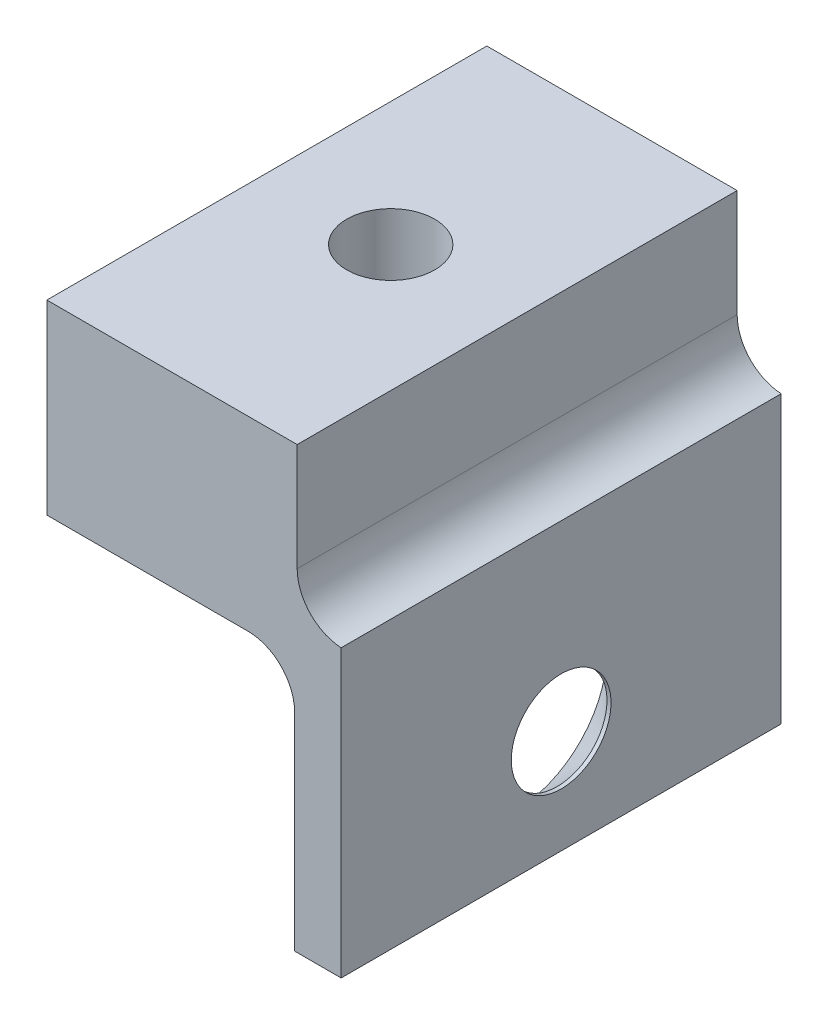
ISO-10303-21;
HEADER;
FILE_DESCRIPTION(('STEP AP214'),'2;1');
FILE_NAME('part.step','',(''),(''),'','','');
FILE_SCHEMA(('AUTOMOTIVE_DESIGN { 1 0 10303 214 1 1 1 1 }'));
ENDSEC;
DATA;
#1=APPLICATION_CONTEXT('core data for automotive mechanical design processes');
#2=APPLICATION_PROTOCOL_DEFINITION('international standard','automotive_design',2000,#1);
#3=PRODUCT_CONTEXT('',#1,'mechanical');
#4=PRODUCT('Part','Part','',(#3));
#5=PRODUCT_RELATED_PRODUCT_CATEGORY('part','',(#4));
#6=PRODUCT_DEFINITION_FORMATION('','',#4);
#7=PRODUCT_DEFINITION_CONTEXT('part definition',#1,'design');
#8=PRODUCT_DEFINITION('design','',#6,#7);
#9=PRODUCT_DEFINITION_SHAPE('','',#8);
#10=(LENGTH_UNIT() NAMED_UNIT(*) SI_UNIT(.MILLI.,.METRE.));
#11=(NAMED_UNIT(*) PLANE_ANGLE_UNIT() SI_UNIT($,.RADIAN.));
#12=(NAMED_UNIT(*) SI_UNIT($,.STERADIAN.) SOLID_ANGLE_UNIT());
#13=UNCERTAINTY_MEASURE_WITH_UNIT(LENGTH_MEASURE(1.E-05),#10,'distance_accuracy_value','');
#14=(GEOMETRIC_REPRESENTATION_CONTEXT(3) GLOBAL_UNCERTAINTY_ASSIGNED_CONTEXT((#13)) GLOBAL_UNIT_ASSIGNED_CONTEXT((#10,
#11,#12)) REPRESENTATION_CONTEXT('',''));
#15=CARTESIAN_POINT('',(0.,0.,0.));
#16=DIRECTION('',(0.,0.,1.));
#17=DIRECTION('',(1.,0.,0.));
#18=AXIS2_PLACEMENT_3D('',#15,#16,#17);
#19=CARTESIAN_POINT('',(0.,-15.0000000000001,7.5));
#20=DIRECTION('',(-1.,0.,0.));
#21=DIRECTION('',(0.,0.,1.));
#22=AXIS2_PLACEMENT_3D('',#19,#20,#21);
#23=PLANE('',#22);
#24=CARTESIAN_POINT('',(0.,-11.4687500000001,0.));
#25=DIRECTION('',(-1.,0.,0.));
#26=DIRECTION('',(0.,0.,1.));
#27=AXIS2_PLACEMENT_3D('',#24,#25,#26);
#28=CIRCLE('',#27,1.7);
#29=CARTESIAN_POINT('',(0.,-11.4687500000001,1.7));
#30=VERTEX_POINT('',#29);
#31=EDGE_CURVE('E240',#30,#30,#28,.T.);
#32=ORIENTED_EDGE('',*,*,#31,.T.);
#33=EDGE_LOOP('',(#32));
#34=FACE_BOUND('',#33,.T.);
#35=DIRECTION('',(0.,1.,0.));
#36=VECTOR('',#35,1.);
#37=CARTESIAN_POINT('',(0.,-15.0000000000001,-7.5));
#38=LINE('',#37,#36);
#39=CARTESIAN_POINT('',(0.,-15.0000000000001,-7.5));
#40=VERTEX_POINT('',#39);
#41=CARTESIAN_POINT('',(0.,-5.25,-7.5));
#42=VERTEX_POINT('',#41);
#43=EDGE_CURVE('E106',#40,#42,#38,.T.);
#44=ORIENTED_EDGE('',*,*,#43,.T.);
#45=DIRECTION('',(0.,0.,1.));
#46=VECTOR('',#45,1.);
#47=CARTESIAN_POINT('',(0.,-5.25,-7.5));
#48=LINE('',#47,#46);
#49=CARTESIAN_POINT('',(0.,-5.25,7.5));
#50=VERTEX_POINT('',#49);
#51=EDGE_CURVE('E115',#42,#50,#48,.T.);
#52=ORIENTED_EDGE('',*,*,#51,.T.);
#53=DIRECTION('',(0.,1.,0.));
#54=VECTOR('',#53,1.);
#55=CARTESIAN_POINT('',(0.,-15.0000000000001,7.5));
#56=LINE('',#55,#54);
#57=CARTESIAN_POINT('',(0.,-15.0000000000001,7.5));
#58=VERTEX_POINT('',#57);
#59=EDGE_CURVE('E131',#58,#50,#56,.T.);
#60=ORIENTED_EDGE('',*,*,#59,.F.);
#61=DIRECTION('',(0.,0.,-1.));
#62=VECTOR('',#61,1.);
#63=CARTESIAN_POINT('',(0.,-15.0000000000001,7.5));
#64=LINE('',#63,#62);
#65=EDGE_CURVE('E117',#58,#40,#64,.T.);
#66=ORIENTED_EDGE('',*,*,#65,.T.);
#67=EDGE_LOOP('',(#44,#52,#60,#66));
#68=FACE_BOUND('',#67,.T.);
#69=ADVANCED_FACE('F33',(#34,#68),#23,.F.);
#70=CARTESIAN_POINT('',(0.,0.,7.5));
#71=DIRECTION('',(0.,-1.,0.));
#72=DIRECTION('',(1.,0.,0.));
#73=AXIS2_PLACEMENT_3D('',#70,#71,#72);
#74=PLANE('',#73);
#75=CARTESIAN_POINT('',(-5.81047243999994,0.,0.));
#76=DIRECTION('',(0.,1.,0.));
#77=DIRECTION('',(0.,0.,1.));
#78=AXIS2_PLACEMENT_3D('',#75,#76,#77);
#79=CIRCLE('',#78,1.5);
#80=CARTESIAN_POINT('',(-5.81047243999994,0.,1.5));
#81=VERTEX_POINT('',#80);
#82=EDGE_CURVE('E123',#81,#81,#79,.T.);
#83=ORIENTED_EDGE('',*,*,#82,.F.);
#84=EDGE_LOOP('',(#83));
#85=FACE_BOUND('',#84,.T.);
#86=DIRECTION('',(-1.,0.,0.));
#87=VECTOR('',#86,1.);
#88=CARTESIAN_POINT('',(0.,0.,7.5));
#89=LINE('',#88,#87);
#90=CARTESIAN_POINT('',(-1.5,0.,7.5));
#91=VERTEX_POINT('',#90);
#92=CARTESIAN_POINT('',(-10.03344488,0.,7.5));
#93=VERTEX_POINT('',#92);
#94=EDGE_CURVE('E133',#91,#93,#89,.T.);
#95=ORIENTED_EDGE('',*,*,#94,.F.);
#96=DIRECTION('',(0.,0.,1.));
#97=VECTOR('',#96,1.);
#98=CARTESIAN_POINT('',(-1.5,0.,-7.5));
#99=LINE('',#98,#97);
#100=CARTESIAN_POINT('',(-1.5,0.,-7.5));
#101=VERTEX_POINT('',#100);
#102=EDGE_CURVE('E121',#101,#91,#99,.T.);
#103=ORIENTED_EDGE('',*,*,#102,.F.);
#104=DIRECTION('',(-1.,0.,0.));
#105=VECTOR('',#104,1.);
#106=CARTESIAN_POINT('',(0.,0.,-7.5));
#107=LINE('',#106,#105);
#108=CARTESIAN_POINT('',(-10.03344488,0.,-7.5));
#109=VERTEX_POINT('',#108);
#110=EDGE_CURVE('E118',#101,#109,#107,.T.);
#111=ORIENTED_EDGE('',*,*,#110,.T.);
#112=DIRECTION('',(0.,0.,-1.));
#113=VECTOR('',#112,1.);
#114=CARTESIAN_POINT('',(-10.03344488,0.,7.5));
#115=LINE('',#114,#113);
#116=EDGE_CURVE('E169',#93,#109,#115,.T.);
#117=ORIENTED_EDGE('',*,*,#116,.F.);
#118=EDGE_LOOP('',(#95,#103,#111,#117));
#119=FACE_BOUND('',#118,.T.);
#120=ADVANCED_FACE('F193',(#85,#119),#74,.F.);
#121=CARTESIAN_POINT('',(-10.03344488,0.,7.5));
#122=DIRECTION('',(1.,0.,0.));
#123=DIRECTION('',(0.,1.,0.));
#124=AXIS2_PLACEMENT_3D('',#121,#122,#123);
#125=PLANE('',#124);
#126=DIRECTION('',(0.,-1.,0.));
#127=VECTOR('',#126,1.);
#128=CARTESIAN_POINT('',(-10.03344488,0.,-7.5));
#129=LINE('',#128,#127);
#130=CARTESIAN_POINT('',(-10.03344488,-6.35000000000008,-7.5));
#131=VERTEX_POINT('',#130);
#132=EDGE_CURVE('E147',#109,#131,#129,.T.);
#133=ORIENTED_EDGE('',*,*,#132,.T.);
#134=DIRECTION('',(0.,0.,-1.));
#135=VECTOR('',#134,1.);
#136=CARTESIAN_POINT('',(-10.03344488,-6.35000000000008,7.5));
#137=LINE('',#136,#135);
#138=CARTESIAN_POINT('',(-10.03344488,-6.35000000000008,7.5));
#139=VERTEX_POINT('',#138);
#140=EDGE_CURVE('E166',#139,#131,#137,.T.);
#141=ORIENTED_EDGE('',*,*,#140,.F.);
#142=DIRECTION('',(0.,-1.,0.));
#143=VECTOR('',#142,1.);
#144=CARTESIAN_POINT('',(-10.03344488,0.,7.5));
#145=LINE('',#144,#143);
#146=EDGE_CURVE('E136',#93,#139,#145,.T.);
#147=ORIENTED_EDGE('',*,*,#146,.F.);
#148=ORIENTED_EDGE('',*,*,#116,.T.);
#149=EDGE_LOOP('',(#133,#141,#147,#148));
#150=FACE_BOUND('',#149,.T.);
#151=ADVANCED_FACE('F198',(#150),#125,.F.);
#152=CARTESIAN_POINT('',(-10.03344488,-6.35000000000008,7.5));
#153=DIRECTION('',(0.,1.,0.));
#154=DIRECTION('',(0.,0.,1.));
#155=AXIS2_PLACEMENT_3D('',#152,#153,#154);
#156=PLANE('',#155);
#157=CARTESIAN_POINT('',(-5.81047243999994,-6.35000000000008,0.));
#158=DIRECTION('',(0.,1.,0.));
#159=DIRECTION('',(0.,0.,1.));
#160=AXIS2_PLACEMENT_3D('',#157,#158,#159);
#161=CIRCLE('',#160,1.5);
#162=CARTESIAN_POINT('',(-5.81047243999994,-6.35000000000008,1.5));
#163=VERTEX_POINT('',#162);
#164=EDGE_CURVE('E119',#163,#163,#161,.T.);
#165=ORIENTED_EDGE('',*,*,#164,.T.);
#166=EDGE_LOOP('',(#165));
#167=FACE_BOUND('',#166,.T.);
#168=DIRECTION('',(1.,0.,0.));
#169=VECTOR('',#168,1.);
#170=CARTESIAN_POINT('',(-10.03344488,-6.35000000000008,-7.5));
#171=LINE('',#170,#169);
#172=CARTESIAN_POINT('',(-3.17500000000001,-6.35000000000008,-7.5));
#173=VERTEX_POINT('',#172);
#174=EDGE_CURVE('E149',#131,#173,#171,.T.);
#175=ORIENTED_EDGE('',*,*,#174,.T.);
#176=DIRECTION('',(0.,0.,-1.));
#177=VECTOR('',#176,1.);
#178=CARTESIAN_POINT('',(-3.17500000000001,-6.35000000000008,7.5));
#179=LINE('',#178,#177);
#180=CARTESIAN_POINT('',(-3.17500000000001,-6.35000000000008,7.5));
#181=VERTEX_POINT('',#180);
#182=EDGE_CURVE('E163',#181,#173,#179,.T.);
#183=ORIENTED_EDGE('',*,*,#182,.F.);
#184=DIRECTION('',(1.,0.,0.));
#185=VECTOR('',#184,1.);
#186=CARTESIAN_POINT('',(-10.03344488,-6.35000000000008,7.5));
#187=LINE('',#186,#185);
#188=EDGE_CURVE('E138',#139,#181,#187,.T.);
#189=ORIENTED_EDGE('',*,*,#188,.F.);
#190=ORIENTED_EDGE('',*,*,#140,.T.);
#191=EDGE_LOOP('',(#175,#183,#189,#190));
#192=FACE_BOUND('',#191,.T.);
#193=ADVANCED_FACE('F176',(#167,#192),#156,.F.);
#194=CARTESIAN_POINT('',(-3.17500000000001,-7.93750000000008,7.5));
#195=DIRECTION('',(0.,0.,-1.));
#196=DIRECTION('',(-1.,0.,0.));
#197=AXIS2_PLACEMENT_3D('',#194,#195,#196);
#198=CYLINDRICAL_SURFACE('',#197,1.5875);
#199=CARTESIAN_POINT('',(-3.17500000000001,-7.93750000000008,-7.5));
#200=DIRECTION('',(0.,0.,-1.));
#201=DIRECTION('',(1.,0.,0.));
#202=AXIS2_PLACEMENT_3D('',#199,#200,#201);
#203=CIRCLE('',#202,1.5875);
#204=CARTESIAN_POINT('',(-1.58750000000001,-7.93750000000008,-7.5));
#205=VERTEX_POINT('',#204);
#206=EDGE_CURVE('E151',#173,#205,#203,.T.);
#207=ORIENTED_EDGE('',*,*,#206,.T.);
#208=DIRECTION('',(0.,0.,-1.));
#209=VECTOR('',#208,1.);
#210=CARTESIAN_POINT('',(-1.58750000000001,-7.93750000000008,7.5));
#211=LINE('',#210,#209);
#212=CARTESIAN_POINT('',(-1.58750000000001,-7.93750000000008,7.5));
#213=VERTEX_POINT('',#212);
#214=EDGE_CURVE('E160',#213,#205,#211,.T.);
#215=ORIENTED_EDGE('',*,*,#214,.F.);
#216=CARTESIAN_POINT('',(-3.17500000000001,-7.93750000000008,7.5));
#217=DIRECTION('',(0.,0.,-1.));
#218=DIRECTION('',(1.,0.,0.));
#219=AXIS2_PLACEMENT_3D('',#216,#217,#218);
#220=CIRCLE('',#219,1.5875);
#221=EDGE_CURVE('E140',#181,#213,#220,.T.);
#222=ORIENTED_EDGE('',*,*,#221,.F.);
#223=ORIENTED_EDGE('',*,*,#182,.T.);
#224=EDGE_LOOP('',(#207,#215,#222,#223));
#225=FACE_BOUND('',#224,.T.);
#226=ADVANCED_FACE('F208',(#225),#198,.F.);
#227=CARTESIAN_POINT('',(-1.58750000000001,-7.93750000000008,7.5));
#228=DIRECTION('',(1.,0.,0.));
#229=DIRECTION('',(0.,1.,0.));
#230=AXIS2_PLACEMENT_3D('',#227,#228,#229);
#231=PLANE('',#230);
#232=CARTESIAN_POINT('',(-1.58750000000001,-11.4687500000001,0.));
#233=DIRECTION('',(-1.,0.,0.));
#234=DIRECTION('',(0.,0.,1.));
#235=AXIS2_PLACEMENT_3D('',#232,#233,#234);
#236=CIRCLE('',#235,3.15);
#237=CARTESIAN_POINT('',(-1.58750000000001,-11.4687500000001,3.15));
#238=VERTEX_POINT('',#237);
#239=EDGE_CURVE('E246',#238,#238,#236,.T.);
#240=ORIENTED_EDGE('',*,*,#239,.F.);
#241=EDGE_LOOP('',(#240));
#242=FACE_BOUND('',#241,.T.);
#243=DIRECTION('',(0.,-1.,0.));
#244=VECTOR('',#243,1.);
#245=CARTESIAN_POINT('',(-1.58750000000001,-7.93750000000008,-7.5));
#246=LINE('',#245,#244);
#247=CARTESIAN_POINT('',(-1.58750000000001,-15.0000000000001,-7.5));
#248=VERTEX_POINT('',#247);
#249=EDGE_CURVE('E153',#205,#248,#246,.T.);
#250=ORIENTED_EDGE('',*,*,#249,.T.);
#251=DIRECTION('',(0.,0.,-1.));
#252=VECTOR('',#251,1.);
#253=CARTESIAN_POINT('',(-1.58750000000001,-15.0000000000001,7.5));
#254=LINE('',#253,#252);
#255=CARTESIAN_POINT('',(-1.58750000000001,-15.0000000000001,7.5));
#256=VERTEX_POINT('',#255);
#257=EDGE_CURVE('E157',#256,#248,#254,.T.);
#258=ORIENTED_EDGE('',*,*,#257,.F.);
#259=DIRECTION('',(0.,-1.,0.));
#260=VECTOR('',#259,1.);
#261=CARTESIAN_POINT('',(-1.58750000000001,-7.93750000000008,7.5));
#262=LINE('',#261,#260);
#263=EDGE_CURVE('E142',#213,#256,#262,.T.);
#264=ORIENTED_EDGE('',*,*,#263,.F.);
#265=ORIENTED_EDGE('',*,*,#214,.T.);
#266=EDGE_LOOP('',(#250,#258,#264,#265));
#267=FACE_BOUND('',#266,.T.);
#268=ADVANCED_FACE('F211',(#242,#267),#231,.F.);
#269=CARTESIAN_POINT('',(-1.58750000000001,-15.0000000000001,7.5));
#270=DIRECTION('',(0.,1.,0.));
#271=DIRECTION('',(0.,0.,1.));
#272=AXIS2_PLACEMENT_3D('',#269,#270,#271);
#273=PLANE('',#272);
#274=DIRECTION('',(1.,0.,0.));
#275=VECTOR('',#274,1.);
#276=CARTESIAN_POINT('',(-1.58750000000001,-15.0000000000001,-7.5));
#277=LINE('',#276,#275);
#278=EDGE_CURVE('E134',#248,#40,#277,.T.);
#279=ORIENTED_EDGE('',*,*,#278,.T.);
#280=ORIENTED_EDGE('',*,*,#65,.F.);
#281=DIRECTION('',(1.,0.,0.));
#282=VECTOR('',#281,1.);
#283=CARTESIAN_POINT('',(-1.58750000000001,-15.0000000000001,7.5));
#284=LINE('',#283,#282);
#285=EDGE_CURVE('E144',#256,#58,#284,.T.);
#286=ORIENTED_EDGE('',*,*,#285,.F.);
#287=ORIENTED_EDGE('',*,*,#257,.T.);
#288=EDGE_LOOP('',(#279,#280,#286,#287));
#289=FACE_BOUND('',#288,.T.);
#290=ADVANCED_FACE('F215',(#289),#273,.F.);
#291=CARTESIAN_POINT('',(-3.17500000000001,-7.93750000000008,7.5));
#292=DIRECTION('',(0.,0.,1.));
#293=DIRECTION('',(1.,0.,0.));
#294=AXIS2_PLACEMENT_3D('',#291,#292,#293);
#295=PLANE('',#294);
#296=ORIENTED_EDGE('',*,*,#59,.T.);
#297=CARTESIAN_POINT('',(0.0874999999999997,-3.66491325158526,7.5));
#298=DIRECTION('',(0.,0.,1.));
#299=DIRECTION('',(1.,0.,0.));
#300=AXIS2_PLACEMENT_3D('',#297,#298,#299);
#301=CIRCLE('',#300,1.5875);
#302=CARTESIAN_POINT('',(-1.5,-3.66491325158526,7.5));
#303=VERTEX_POINT('',#302);
#304=EDGE_CURVE('E41',#50,#303,#301,.F.);
#305=ORIENTED_EDGE('',*,*,#304,.T.);
#306=DIRECTION('',(0.,-1.,0.));
#307=VECTOR('',#306,1.);
#308=CARTESIAN_POINT('',(-1.5,-5.25,7.5));
#309=LINE('',#308,#307);
#310=EDGE_CURVE('E125',#91,#303,#309,.T.);
#311=ORIENTED_EDGE('',*,*,#310,.F.);
#312=ORIENTED_EDGE('',*,*,#94,.T.);
#313=ORIENTED_EDGE('',*,*,#146,.T.);
#314=ORIENTED_EDGE('',*,*,#188,.T.);
#315=ORIENTED_EDGE('',*,*,#221,.T.);
#316=ORIENTED_EDGE('',*,*,#263,.T.);
#317=ORIENTED_EDGE('',*,*,#285,.T.);
#318=EDGE_LOOP('',(#296,#305,#311,#312,#313,#314,#315,#316,#317));
#319=FACE_BOUND('',#318,.T.);
#320=ADVANCED_FACE('F189',(#319),#295,.T.);
#321=CARTESIAN_POINT('',(-3.17500000000001,-7.93750000000008,-7.5));
#322=DIRECTION('',(0.,0.,1.));
#323=DIRECTION('',(1.,0.,0.));
#324=AXIS2_PLACEMENT_3D('',#321,#322,#323);
#325=PLANE('',#324);
#326=DIRECTION('',(0.,-1.,0.));
#327=VECTOR('',#326,1.);
#328=CARTESIAN_POINT('',(-1.5,-5.25,-7.5));
#329=LINE('',#328,#327);
#330=CARTESIAN_POINT('',(-1.5,-3.66491325158526,-7.5));
#331=VERTEX_POINT('',#330);
#332=EDGE_CURVE('E108',#101,#331,#329,.T.);
#333=ORIENTED_EDGE('',*,*,#332,.T.);
#334=CARTESIAN_POINT('',(0.0874999999999997,-3.66491325158526,-7.5));
#335=DIRECTION('',(0.,0.,1.));
#336=DIRECTION('',(1.,0.,0.));
#337=AXIS2_PLACEMENT_3D('',#334,#335,#336);
#338=CIRCLE('',#337,1.5875);
#339=EDGE_CURVE('E11',#331,#42,#338,.T.);
#340=ORIENTED_EDGE('',*,*,#339,.T.);
#341=ORIENTED_EDGE('',*,*,#43,.F.);
#342=ORIENTED_EDGE('',*,*,#278,.F.);
#343=ORIENTED_EDGE('',*,*,#249,.F.);
#344=ORIENTED_EDGE('',*,*,#206,.F.);
#345=ORIENTED_EDGE('',*,*,#174,.F.);
#346=ORIENTED_EDGE('',*,*,#132,.F.);
#347=ORIENTED_EDGE('',*,*,#110,.F.);
#348=EDGE_LOOP('',(#333,#340,#341,#342,#343,#344,#345,#346,#347));
#349=FACE_BOUND('',#348,.T.);
#350=ADVANCED_FACE('F104',(#349),#325,.F.);
#351=CARTESIAN_POINT('',(-5.81047243999994,-15.0000000000001,0.));
#352=DIRECTION('',(0.,1.,0.));
#353=DIRECTION('',(0.,0.,1.));
#354=AXIS2_PLACEMENT_3D('',#351,#352,#353);
#355=CYLINDRICAL_SURFACE('',#354,1.5);
#356=ORIENTED_EDGE('',*,*,#82,.T.);
#357=EDGE_LOOP('',(#356));
#358=FACE_BOUND('',#357,.T.);
#359=ORIENTED_EDGE('',*,*,#164,.F.);
#360=EDGE_LOOP('',(#359));
#361=FACE_BOUND('',#360,.T.);
#362=ADVANCED_FACE('F179',(#358,#361),#355,.F.);
#363=CARTESIAN_POINT('',(-1.5,-5.25,-7.5));
#364=DIRECTION('',(-1.,0.,0.));
#365=DIRECTION('',(0.,0.,1.));
#366=AXIS2_PLACEMENT_3D('',#363,#364,#365);
#367=PLANE('',#366);
#368=ORIENTED_EDGE('',*,*,#310,.T.);
#369=DIRECTION('',(0.,0.,-1.));
#370=VECTOR('',#369,1.);
#371=CARTESIAN_POINT('',(-1.5,-3.66491325158526,-7.5));
#372=LINE('',#371,#370);
#373=EDGE_CURVE('E48',#303,#331,#372,.T.);
#374=ORIENTED_EDGE('',*,*,#373,.T.);
#375=ORIENTED_EDGE('',*,*,#332,.F.);
#376=ORIENTED_EDGE('',*,*,#102,.T.);
#377=EDGE_LOOP('',(#368,#374,#375,#376));
#378=FACE_BOUND('',#377,.T.);
#379=ADVANCED_FACE('F181',(#378),#367,.F.);
#380=CARTESIAN_POINT('',(0.0874999999999997,-3.66491325158526,-7.5));
#381=DIRECTION('',(0.,0.,-1.));
#382=DIRECTION('',(-1.,0.,0.));
#383=AXIS2_PLACEMENT_3D('',#380,#381,#382);
#384=CYLINDRICAL_SURFACE('',#383,1.5875);
#385=ORIENTED_EDGE('',*,*,#339,.F.);
#386=ORIENTED_EDGE('',*,*,#373,.F.);
#387=ORIENTED_EDGE('',*,*,#304,.F.);
#388=ORIENTED_EDGE('',*,*,#51,.F.);
#389=EDGE_LOOP('',(#385,#386,#387,#388));
#390=FACE_BOUND('',#389,.T.);
#391=ADVANCED_FACE('F35',(#390),#384,.F.);
#392=CARTESIAN_POINT('',(-1.58750000000001,-11.4687500000001,0.));
#393=DIRECTION('',(-1.,0.,0.));
#394=DIRECTION('',(0.,0.,1.));
#395=AXIS2_PLACEMENT_3D('',#392,#393,#394);
#396=CYLINDRICAL_SURFACE('',#395,1.7);
#397=ORIENTED_EDGE('',*,*,#31,.F.);
#398=EDGE_LOOP('',(#397));
#399=FACE_BOUND('',#398,.T.);
#400=CARTESIAN_POINT('',(-0.137500000000012,-11.4687500000001,0.));
#401=DIRECTION('',(-1.,0.,0.));
#402=DIRECTION('',(0.,0.,1.));
#403=AXIS2_PLACEMENT_3D('',#400,#401,#402);
#404=CIRCLE('',#403,1.7);
#405=CARTESIAN_POINT('',(-0.137500000000012,-11.4687500000001,1.7));
#406=VERTEX_POINT('',#405);
#407=EDGE_CURVE('E241',#406,#406,#404,.T.);
#408=ORIENTED_EDGE('',*,*,#407,.T.);
#409=EDGE_LOOP('',(#408));
#410=FACE_BOUND('',#409,.T.);
#411=ADVANCED_FACE('F252',(#399,#410),#396,.F.);
#412=CARTESIAN_POINT('',(-1.58750000000001,-11.4687500000001,0.));
#413=DIRECTION('',(-1.,0.,0.));
#414=DIRECTION('',(0.,0.,1.));
#415=AXIS2_PLACEMENT_3D('',#412,#413,#414);
#416=CONICAL_SURFACE('',#415,3.15,0.785398163397449);
#417=ORIENTED_EDGE('',*,*,#407,.F.);
#418=EDGE_LOOP('',(#417));
#419=FACE_BOUND('',#418,.T.);
#420=ORIENTED_EDGE('',*,*,#239,.T.);
#421=EDGE_LOOP('',(#420));
#422=FACE_BOUND('',#421,.T.);
#423=ADVANCED_FACE('F250',(#419,#422),#416,.F.);
#424=CLOSED_SHELL('',(#69,#120,#151,#193,#226,#268,#290,#320,#350,#362,#379,#391,#411,#423));
#425=MANIFOLD_SOLID_BREP('B2',#424);
#426=ADVANCED_BREP_SHAPE_REPRESENTATION('',(#18,#425),#14);
#427=SHAPE_DEFINITION_REPRESENTATION(#9,#426);
ENDSEC;
END-ISO-10303-21;
